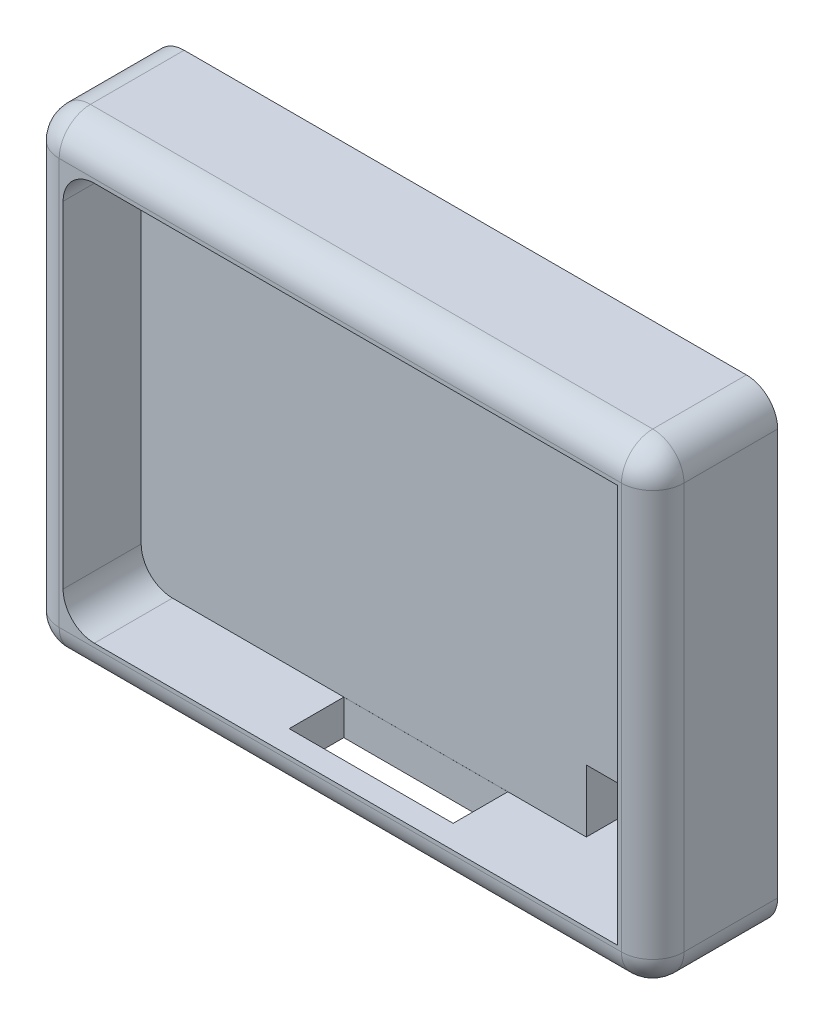
ISO-10303-21;
HEADER;
FILE_DESCRIPTION(('STEP AP214'),'2;1');
FILE_NAME('part.step','',(''),(''),'','','');
FILE_SCHEMA(('AUTOMOTIVE_DESIGN { 1 0 10303 214 1 1 1 1 }'));
ENDSEC;
DATA;
#1=APPLICATION_CONTEXT('core data for automotive mechanical design processes');
#2=APPLICATION_PROTOCOL_DEFINITION('international standard','automotive_design',2000,#1);
#3=PRODUCT_CONTEXT('',#1,'mechanical');
#4=PRODUCT('Part','Part','',(#3));
#5=PRODUCT_RELATED_PRODUCT_CATEGORY('part','',(#4));
#6=PRODUCT_DEFINITION_FORMATION('','',#4);
#7=PRODUCT_DEFINITION_CONTEXT('part definition',#1,'design');
#8=PRODUCT_DEFINITION('design','',#6,#7);
#9=PRODUCT_DEFINITION_SHAPE('','',#8);
#10=(LENGTH_UNIT() NAMED_UNIT(*) SI_UNIT(.MILLI.,.METRE.));
#11=(NAMED_UNIT(*) PLANE_ANGLE_UNIT() SI_UNIT($,.RADIAN.));
#12=(NAMED_UNIT(*) SI_UNIT($,.STERADIAN.) SOLID_ANGLE_UNIT());
#13=UNCERTAINTY_MEASURE_WITH_UNIT(LENGTH_MEASURE(1.E-05),#10,'distance_accuracy_value','');
#14=(GEOMETRIC_REPRESENTATION_CONTEXT(3) GLOBAL_UNCERTAINTY_ASSIGNED_CONTEXT((#13)) GLOBAL_UNIT_ASSIGNED_CONTEXT((#10,
#11,#12)) REPRESENTATION_CONTEXT('',''));
#15=CARTESIAN_POINT('',(0.,0.,0.));
#16=DIRECTION('',(0.,0.,1.));
#17=DIRECTION('',(1.,0.,0.));
#18=AXIS2_PLACEMENT_3D('',#15,#16,#17);
#19=CARTESIAN_POINT('',(0.,0.,8.));
#20=DIRECTION('',(1.,0.,0.));
#21=DIRECTION('',(0.,0.,-1.));
#22=AXIS2_PLACEMENT_3D('',#19,#20,#21);
#23=PLANE('',#22);
#24=DIRECTION('',(0.,-1.,0.));
#25=VECTOR('',#24,1.);
#26=CARTESIAN_POINT('',(0.,0.,0.));
#27=LINE('',#26,#25);
#28=CARTESIAN_POINT('',(0.,28.,0.));
#29=VERTEX_POINT('',#28);
#30=CARTESIAN_POINT('',(0.,2.,0.));
#31=VERTEX_POINT('',#30);
#32=EDGE_CURVE('E277',#29,#31,#27,.T.);
#33=ORIENTED_EDGE('',*,*,#32,.T.);
#34=DIRECTION('',(0.,0.,-1.));
#35=VECTOR('',#34,1.);
#36=CARTESIAN_POINT('',(0.,2.,8.));
#37=LINE('',#36,#35);
#38=CARTESIAN_POINT('',(0.,2.,6.));
#39=VERTEX_POINT('',#38);
#40=EDGE_CURVE('E342',#31,#39,#37,.F.);
#41=ORIENTED_EDGE('',*,*,#40,.T.);
#42=DIRECTION('',(0.,-1.,0.));
#43=VECTOR('',#42,1.);
#44=CARTESIAN_POINT('',(0.,0.,6.));
#45=LINE('',#44,#43);
#46=CARTESIAN_POINT('',(0.,28.,6.));
#47=VERTEX_POINT('',#46);
#48=EDGE_CURVE('E340',#39,#47,#45,.F.);
#49=ORIENTED_EDGE('',*,*,#48,.T.);
#50=DIRECTION('',(0.,0.,-1.));
#51=VECTOR('',#50,1.);
#52=CARTESIAN_POINT('',(0.,28.,8.));
#53=LINE('',#52,#51);
#54=EDGE_CURVE('E338',#47,#29,#53,.T.);
#55=ORIENTED_EDGE('',*,*,#54,.T.);
#56=EDGE_LOOP('',(#33,#41,#49,#55));
#57=FACE_BOUND('',#56,.T.);
#58=ADVANCED_FACE('F35',(#57),#23,.F.);
#59=CARTESIAN_POINT('',(0.,0.,8.));
#60=DIRECTION('',(0.,1.,0.));
#61=DIRECTION('',(0.,0.,1.));
#62=AXIS2_PLACEMENT_3D('',#59,#60,#61);
#63=PLANE('',#62);
#64=DIRECTION('',(1.,0.,0.));
#65=VECTOR('',#64,1.);
#66=CARTESIAN_POINT('',(0.,0.,6.));
#67=LINE('',#66,#65);
#68=CARTESIAN_POINT('',(38.,0.,6.));
#69=VERTEX_POINT('',#68);
#70=CARTESIAN_POINT('',(25.7257710311441,0.,6.));
#71=VERTEX_POINT('',#70);
#72=EDGE_CURVE('E321',#69,#71,#67,.F.);
#73=ORIENTED_EDGE('',*,*,#72,.T.);
#74=DIRECTION('',(0.,0.,1.));
#75=VECTOR('',#74,1.);
#76=CARTESIAN_POINT('',(25.7257710311441,0.,3.00242586469449));
#77=LINE('',#76,#75);
#78=CARTESIAN_POINT('',(25.7257710311441,0.,3.00242586469449));
#79=VERTEX_POINT('',#78);
#80=EDGE_CURVE('E226',#79,#71,#77,.T.);
#81=ORIENTED_EDGE('',*,*,#80,.F.);
#82=DIRECTION('',(1.,0.,0.));
#83=VECTOR('',#82,1.);
#84=CARTESIAN_POINT('',(15.2257710311441,0.,3.00242586469449));
#85=LINE('',#84,#83);
#86=CARTESIAN_POINT('',(15.2257710311441,0.,3.00242586469449));
#87=VERTEX_POINT('',#86);
#88=EDGE_CURVE('E223',#87,#79,#85,.T.);
#89=ORIENTED_EDGE('',*,*,#88,.F.);
#90=DIRECTION('',(0.,0.,-1.));
#91=VECTOR('',#90,1.);
#92=CARTESIAN_POINT('',(15.2257710311441,0.,3.00242586469449));
#93=LINE('',#92,#91);
#94=CARTESIAN_POINT('',(15.2257710311441,0.,6.));
#95=VERTEX_POINT('',#94);
#96=EDGE_CURVE('E201',#95,#87,#93,.T.);
#97=ORIENTED_EDGE('',*,*,#96,.F.);
#98=CARTESIAN_POINT('',(2.,0.,6.));
#99=VERTEX_POINT('',#98);
#100=EDGE_CURVE('E320',#95,#99,#67,.F.);
#101=ORIENTED_EDGE('',*,*,#100,.T.);
#102=DIRECTION('',(0.,0.,-1.));
#103=VECTOR('',#102,1.);
#104=CARTESIAN_POINT('',(2.,0.,8.));
#105=LINE('',#104,#103);
#106=CARTESIAN_POINT('',(2.,0.,0.));
#107=VERTEX_POINT('',#106);
#108=EDGE_CURVE('E324',#99,#107,#105,.T.);
#109=ORIENTED_EDGE('',*,*,#108,.T.);
#110=DIRECTION('',(1.,0.,0.));
#111=VECTOR('',#110,1.);
#112=CARTESIAN_POINT('',(0.,0.,0.));
#113=LINE('',#112,#111);
#114=CARTESIAN_POINT('',(38.,0.,0.));
#115=VERTEX_POINT('',#114);
#116=EDGE_CURVE('E282',#107,#115,#113,.T.);
#117=ORIENTED_EDGE('',*,*,#116,.T.);
#118=DIRECTION('',(0.,0.,-1.));
#119=VECTOR('',#118,1.);
#120=CARTESIAN_POINT('',(38.,0.,8.));
#121=LINE('',#120,#119);
#122=EDGE_CURVE('E318',#115,#69,#121,.F.);
#123=ORIENTED_EDGE('',*,*,#122,.T.);
#124=EDGE_LOOP('',(#73,#81,#89,#97,#101,#109,#117,#123));
#125=FACE_BOUND('',#124,.T.);
#126=ADVANCED_FACE('F396',(#125),#63,.F.);
#127=CARTESIAN_POINT('',(40.,0.,8.));
#128=DIRECTION('',(-1.,0.,0.));
#129=DIRECTION('',(0.,0.,1.));
#130=AXIS2_PLACEMENT_3D('',#127,#128,#129);
#131=PLANE('',#130);
#132=DIRECTION('',(0.,1.,0.));
#133=VECTOR('',#132,1.);
#134=CARTESIAN_POINT('',(40.,0.,6.));
#135=LINE('',#134,#133);
#136=CARTESIAN_POINT('',(40.,28.,6.));
#137=VERTEX_POINT('',#136);
#138=CARTESIAN_POINT('',(40.,2.,6.));
#139=VERTEX_POINT('',#138);
#140=EDGE_CURVE('E328',#137,#139,#135,.F.);
#141=ORIENTED_EDGE('',*,*,#140,.T.);
#142=DIRECTION('',(0.,0.,-1.));
#143=VECTOR('',#142,1.);
#144=CARTESIAN_POINT('',(40.,2.,8.));
#145=LINE('',#144,#143);
#146=CARTESIAN_POINT('',(40.,2.,0.));
#147=VERTEX_POINT('',#146);
#148=EDGE_CURVE('E330',#139,#147,#145,.T.);
#149=ORIENTED_EDGE('',*,*,#148,.T.);
#150=DIRECTION('',(0.,1.,0.));
#151=VECTOR('',#150,1.);
#152=CARTESIAN_POINT('',(40.,0.,0.));
#153=LINE('',#152,#151);
#154=CARTESIAN_POINT('',(40.,28.,0.));
#155=VERTEX_POINT('',#154);
#156=EDGE_CURVE('E285',#147,#155,#153,.T.);
#157=ORIENTED_EDGE('',*,*,#156,.T.);
#158=DIRECTION('',(0.,0.,-1.));
#159=VECTOR('',#158,1.);
#160=CARTESIAN_POINT('',(40.,28.,8.));
#161=LINE('',#160,#159);
#162=EDGE_CURVE('E326',#155,#137,#161,.F.);
#163=ORIENTED_EDGE('',*,*,#162,.T.);
#164=EDGE_LOOP('',(#141,#149,#157,#163));
#165=FACE_BOUND('',#164,.T.);
#166=ADVANCED_FACE('F442',(#165),#131,.F.);
#167=CARTESIAN_POINT('',(0.,30.,8.));
#168=DIRECTION('',(0.,-1.,0.));
#169=DIRECTION('',(0.,0.,-1.));
#170=AXIS2_PLACEMENT_3D('',#167,#168,#169);
#171=PLANE('',#170);
#172=DIRECTION('',(-1.,0.,0.));
#173=VECTOR('',#172,1.);
#174=CARTESIAN_POINT('',(0.,30.,6.));
#175=LINE('',#174,#173);
#176=CARTESIAN_POINT('',(2.,30.,6.));
#177=VERTEX_POINT('',#176);
#178=CARTESIAN_POINT('',(38.,30.,6.));
#179=VERTEX_POINT('',#178);
#180=EDGE_CURVE('E334',#177,#179,#175,.F.);
#181=ORIENTED_EDGE('',*,*,#180,.T.);
#182=DIRECTION('',(0.,0.,-1.));
#183=VECTOR('',#182,1.);
#184=CARTESIAN_POINT('',(38.,30.,8.));
#185=LINE('',#184,#183);
#186=CARTESIAN_POINT('',(38.,30.,0.));
#187=VERTEX_POINT('',#186);
#188=EDGE_CURVE('E336',#179,#187,#185,.T.);
#189=ORIENTED_EDGE('',*,*,#188,.T.);
#190=DIRECTION('',(-1.,0.,0.));
#191=VECTOR('',#190,1.);
#192=CARTESIAN_POINT('',(0.,30.,0.));
#193=LINE('',#192,#191);
#194=CARTESIAN_POINT('',(2.,30.,0.));
#195=VERTEX_POINT('',#194);
#196=EDGE_CURVE('E288',#187,#195,#193,.T.);
#197=ORIENTED_EDGE('',*,*,#196,.T.);
#198=DIRECTION('',(0.,0.,-1.));
#199=VECTOR('',#198,1.);
#200=CARTESIAN_POINT('',(2.,30.,8.));
#201=LINE('',#200,#199);
#202=EDGE_CURVE('E332',#195,#177,#201,.F.);
#203=ORIENTED_EDGE('',*,*,#202,.T.);
#204=EDGE_LOOP('',(#181,#189,#197,#203));
#205=FACE_BOUND('',#204,.T.);
#206=ADVANCED_FACE('F687',(#205),#171,.F.);
#207=CARTESIAN_POINT('',(0.,0.,8.));
#208=DIRECTION('',(0.,0.,-1.));
#209=DIRECTION('',(-1.,0.,0.));
#210=AXIS2_PLACEMENT_3D('',#207,#208,#209);
#211=PLANE('',#210);
#212=DIRECTION('',(0.,-1.,0.));
#213=VECTOR('',#212,1.);
#214=CARTESIAN_POINT('',(2.,0.,8.));
#215=LINE('',#214,#213);
#216=CARTESIAN_POINT('',(2.,28.,8.));
#217=VERTEX_POINT('',#216);
#218=CARTESIAN_POINT('',(2.,2.,8.));
#219=VERTEX_POINT('',#218);
#220=EDGE_CURVE('E309',#217,#219,#215,.T.);
#221=ORIENTED_EDGE('',*,*,#220,.T.);
#222=DIRECTION('',(1.,0.,0.));
#223=VECTOR('',#222,1.);
#224=CARTESIAN_POINT('',(0.,2.,8.));
#225=LINE('',#224,#223);
#226=CARTESIAN_POINT('',(38.,2.,8.));
#227=VERTEX_POINT('',#226);
#228=EDGE_CURVE('E315',#219,#227,#225,.T.);
#229=ORIENTED_EDGE('',*,*,#228,.T.);
#230=DIRECTION('',(0.,1.,0.));
#231=VECTOR('',#230,1.);
#232=CARTESIAN_POINT('',(38.,0.,8.));
#233=LINE('',#232,#231);
#234=CARTESIAN_POINT('',(38.,28.,8.));
#235=VERTEX_POINT('',#234);
#236=EDGE_CURVE('E313',#227,#235,#233,.T.);
#237=ORIENTED_EDGE('',*,*,#236,.T.);
#238=DIRECTION('',(-1.,0.,0.));
#239=VECTOR('',#238,1.);
#240=CARTESIAN_POINT('',(0.,28.,8.));
#241=LINE('',#240,#239);
#242=EDGE_CURVE('E311',#235,#217,#241,.T.);
#243=ORIENTED_EDGE('',*,*,#242,.T.);
#244=EDGE_LOOP('',(#221,#229,#237,#243));
#245=FACE_BOUND('',#244,.T.);
#246=DIRECTION('',(-1.,0.,0.));
#247=VECTOR('',#246,1.);
#248=CARTESIAN_POINT('',(2.25,27.75,8.));
#249=LINE('',#248,#247);
#250=CARTESIAN_POINT('',(37.75,27.75,8.));
#251=VERTEX_POINT('',#250);
#252=CARTESIAN_POINT('',(4.25,27.75,8.));
#253=VERTEX_POINT('',#252);
#254=EDGE_CURVE('E266',#251,#253,#249,.T.);
#255=ORIENTED_EDGE('',*,*,#254,.F.);
#256=DIRECTION('',(0.,1.,0.));
#257=VECTOR('',#256,1.);
#258=CARTESIAN_POINT('',(37.75,27.75,8.));
#259=LINE('',#258,#257);
#260=CARTESIAN_POINT('',(37.75,2.25,8.));
#261=VERTEX_POINT('',#260);
#262=EDGE_CURVE('E264',#261,#251,#259,.T.);
#263=ORIENTED_EDGE('',*,*,#262,.F.);
#264=DIRECTION('',(1.,0.,0.));
#265=VECTOR('',#264,1.);
#266=CARTESIAN_POINT('',(2.25000000000001,2.25,8.));
#267=LINE('',#266,#265);
#268=CARTESIAN_POINT('',(4.25,2.25,8.));
#269=VERTEX_POINT('',#268);
#270=EDGE_CURVE('E254',#269,#261,#267,.T.);
#271=ORIENTED_EDGE('',*,*,#270,.F.);
#272=CARTESIAN_POINT('',(4.25,4.25,8.));
#273=DIRECTION('',(0.,0.,-1.));
#274=DIRECTION('',(-1.,0.,0.));
#275=AXIS2_PLACEMENT_3D('',#272,#273,#274);
#276=CIRCLE('',#275,2.);
#277=CARTESIAN_POINT('',(2.25,4.25,8.));
#278=VERTEX_POINT('',#277);
#279=EDGE_CURVE('E305',#269,#278,#276,.T.);
#280=ORIENTED_EDGE('',*,*,#279,.T.);
#281=DIRECTION('',(0.,-1.,0.));
#282=VECTOR('',#281,1.);
#283=CARTESIAN_POINT('',(2.25,27.75,8.));
#284=LINE('',#283,#282);
#285=CARTESIAN_POINT('',(2.25,25.75,8.));
#286=VERTEX_POINT('',#285);
#287=EDGE_CURVE('E270',#286,#278,#284,.T.);
#288=ORIENTED_EDGE('',*,*,#287,.F.);
#289=CARTESIAN_POINT('',(4.25,25.75,8.));
#290=DIRECTION('',(0.,0.,-1.));
#291=DIRECTION('',(-1.,0.,0.));
#292=AXIS2_PLACEMENT_3D('',#289,#290,#291);
#293=CIRCLE('',#292,2.);
#294=EDGE_CURVE('E307',#286,#253,#293,.T.);
#295=ORIENTED_EDGE('',*,*,#294,.T.);
#296=EDGE_LOOP('',(#255,#263,#271,#280,#288,#295));
#297=FACE_BOUND('',#296,.T.);
#298=ADVANCED_FACE('F417',(#245,#297),#211,.F.);
#299=CARTESIAN_POINT('',(0.,0.,0.));
#300=DIRECTION('',(0.,0.,-1.));
#301=DIRECTION('',(-1.,0.,0.));
#302=AXIS2_PLACEMENT_3D('',#299,#300,#301);
#303=PLANE('',#302);
#304=DIRECTION('',(-1.,0.,0.));
#305=VECTOR('',#304,1.);
#306=CARTESIAN_POINT('',(37.75,6.25,0.));
#307=LINE('',#306,#305);
#308=CARTESIAN_POINT('',(37.75,6.25,0.));
#309=VERTEX_POINT('',#308);
#310=CARTESIAN_POINT('',(30.75,6.25,0.));
#311=VERTEX_POINT('',#310);
#312=EDGE_CURVE('E230',#309,#311,#307,.T.);
#313=ORIENTED_EDGE('',*,*,#312,.T.);
#314=DIRECTION('',(0.,-1.,0.));
#315=VECTOR('',#314,1.);
#316=CARTESIAN_POINT('',(30.75,2.25,0.));
#317=LINE('',#316,#315);
#318=CARTESIAN_POINT('',(30.75,2.25,0.));
#319=VERTEX_POINT('',#318);
#320=EDGE_CURVE('E243',#311,#319,#317,.T.);
#321=ORIENTED_EDGE('',*,*,#320,.T.);
#322=DIRECTION('',(1.,0.,0.));
#323=VECTOR('',#322,1.);
#324=CARTESIAN_POINT('',(37.75,2.25,0.));
#325=LINE('',#324,#323);
#326=CARTESIAN_POINT('',(37.75,2.25,0.));
#327=VERTEX_POINT('',#326);
#328=EDGE_CURVE('E239',#319,#327,#325,.T.);
#329=ORIENTED_EDGE('',*,*,#328,.T.);
#330=DIRECTION('',(0.,1.,0.));
#331=VECTOR('',#330,1.);
#332=CARTESIAN_POINT('',(37.75,2.25,0.));
#333=LINE('',#332,#331);
#334=EDGE_CURVE('E235',#327,#309,#333,.T.);
#335=ORIENTED_EDGE('',*,*,#334,.T.);
#336=EDGE_LOOP('',(#313,#321,#329,#335));
#337=FACE_BOUND('',#336,.T.);
#338=ORIENTED_EDGE('',*,*,#116,.F.);
#339=CARTESIAN_POINT('',(2.,2.,0.));
#340=DIRECTION('',(0.,0.,-1.));
#341=DIRECTION('',(-1.,0.,0.));
#342=AXIS2_PLACEMENT_3D('',#339,#340,#341);
#343=CIRCLE('',#342,2.);
#344=EDGE_CURVE('E350',#107,#31,#343,.T.);
#345=ORIENTED_EDGE('',*,*,#344,.T.);
#346=ORIENTED_EDGE('',*,*,#32,.F.);
#347=CARTESIAN_POINT('',(2.,28.,0.));
#348=DIRECTION('',(0.,0.,-1.));
#349=DIRECTION('',(-1.,0.,0.));
#350=AXIS2_PLACEMENT_3D('',#347,#348,#349);
#351=CIRCLE('',#350,2.);
#352=EDGE_CURVE('E344',#29,#195,#351,.T.);
#353=ORIENTED_EDGE('',*,*,#352,.T.);
#354=ORIENTED_EDGE('',*,*,#196,.F.);
#355=CARTESIAN_POINT('',(38.,28.,0.));
#356=DIRECTION('',(0.,0.,-1.));
#357=DIRECTION('',(-1.,0.,0.));
#358=AXIS2_PLACEMENT_3D('',#355,#356,#357);
#359=CIRCLE('',#358,2.);
#360=EDGE_CURVE('E346',#187,#155,#359,.T.);
#361=ORIENTED_EDGE('',*,*,#360,.T.);
#362=ORIENTED_EDGE('',*,*,#156,.F.);
#363=CARTESIAN_POINT('',(38.,2.,0.));
#364=DIRECTION('',(0.,0.,-1.));
#365=DIRECTION('',(-1.,0.,0.));
#366=AXIS2_PLACEMENT_3D('',#363,#364,#365);
#367=CIRCLE('',#366,2.);
#368=EDGE_CURVE('E348',#147,#115,#367,.T.);
#369=ORIENTED_EDGE('',*,*,#368,.T.);
#370=EDGE_LOOP('',(#338,#345,#346,#353,#354,#361,#362,#369));
#371=FACE_BOUND('',#370,.T.);
#372=ADVANCED_FACE('F435',(#337,#371),#303,.T.);
#373=CARTESIAN_POINT('',(37.75,27.75,3.));
#374=DIRECTION('',(1.,0.,0.));
#375=DIRECTION('',(0.,1.,0.));
#376=AXIS2_PLACEMENT_3D('',#373,#374,#375);
#377=PLANE('',#376);
#378=ORIENTED_EDGE('',*,*,#262,.T.);
#379=DIRECTION('',(0.,0.,1.));
#380=VECTOR('',#379,1.);
#381=CARTESIAN_POINT('',(37.75,27.75,3.));
#382=LINE('',#381,#380);
#383=CARTESIAN_POINT('',(37.75,27.75,3.));
#384=VERTEX_POINT('',#383);
#385=EDGE_CURVE('E263',#384,#251,#382,.T.);
#386=ORIENTED_EDGE('',*,*,#385,.F.);
#387=DIRECTION('',(0.,1.,0.));
#388=VECTOR('',#387,1.);
#389=CARTESIAN_POINT('',(37.75,27.75,3.));
#390=LINE('',#389,#388);
#391=CARTESIAN_POINT('',(37.75,6.25,3.));
#392=VERTEX_POINT('',#391);
#393=EDGE_CURVE('E251',#392,#384,#390,.T.);
#394=ORIENTED_EDGE('',*,*,#393,.F.);
#395=DIRECTION('',(0.,0.,1.));
#396=VECTOR('',#395,1.);
#397=CARTESIAN_POINT('',(37.75,6.25,-8.06225774829855));
#398=LINE('',#397,#396);
#399=EDGE_CURVE('E238',#309,#392,#398,.T.);
#400=ORIENTED_EDGE('',*,*,#399,.F.);
#401=ORIENTED_EDGE('',*,*,#334,.F.);
#402=DIRECTION('',(0.,0.,1.));
#403=VECTOR('',#402,1.);
#404=CARTESIAN_POINT('',(37.75,2.25,3.));
#405=LINE('',#404,#403);
#406=EDGE_CURVE('E274',#327,#261,#405,.T.);
#407=ORIENTED_EDGE('',*,*,#406,.T.);
#408=EDGE_LOOP('',(#378,#386,#394,#400,#401,#407));
#409=FACE_BOUND('',#408,.T.);
#410=ADVANCED_FACE('F564',(#409),#377,.F.);
#411=CARTESIAN_POINT('',(2.25000000000001,2.25,3.));
#412=DIRECTION('',(0.,-1.,0.));
#413=DIRECTION('',(0.,0.,-1.));
#414=AXIS2_PLACEMENT_3D('',#411,#412,#413);
#415=PLANE('',#414);
#416=DIRECTION('',(-1.,0.,0.));
#417=VECTOR('',#416,1.);
#418=CARTESIAN_POINT('',(15.2257710311441,2.25,3.00242586469449));
#419=LINE('',#418,#417);
#420=CARTESIAN_POINT('',(25.7257710311441,2.25,3.00242586469449));
#421=VERTEX_POINT('',#420);
#422=CARTESIAN_POINT('',(15.2257710311441,2.25,3.00242586469449));
#423=VERTEX_POINT('',#422);
#424=EDGE_CURVE('E207',#421,#423,#419,.T.);
#425=ORIENTED_EDGE('',*,*,#424,.F.);
#426=DIRECTION('',(0.,0.,-1.));
#427=VECTOR('',#426,1.);
#428=CARTESIAN_POINT('',(25.7257710311441,2.25,3.00242586469449));
#429=LINE('',#428,#427);
#430=CARTESIAN_POINT('',(25.7257710311441,2.25,6.50242586469449));
#431=VERTEX_POINT('',#430);
#432=EDGE_CURVE('E50',#431,#421,#429,.T.);
#433=ORIENTED_EDGE('',*,*,#432,.F.);
#434=DIRECTION('',(1.,0.,0.));
#435=VECTOR('',#434,1.);
#436=CARTESIAN_POINT('',(15.2257710311441,2.25,6.50242586469449));
#437=LINE('',#436,#435);
#438=CARTESIAN_POINT('',(15.2257710311441,2.25,6.50242586469449));
#439=VERTEX_POINT('',#438);
#440=EDGE_CURVE('E214',#439,#431,#437,.T.);
#441=ORIENTED_EDGE('',*,*,#440,.F.);
#442=DIRECTION('',(0.,0.,1.));
#443=VECTOR('',#442,1.);
#444=CARTESIAN_POINT('',(15.2257710311441,2.25,3.00242586469449));
#445=LINE('',#444,#443);
#446=EDGE_CURVE('E198',#423,#439,#445,.T.);
#447=ORIENTED_EDGE('',*,*,#446,.F.);
#448=EDGE_LOOP('',(#425,#433,#441,#447));
#449=FACE_BOUND('',#448,.T.);
#450=DIRECTION('',(1.,0.,0.));
#451=VECTOR('',#450,1.);
#452=CARTESIAN_POINT('',(2.25000000000001,2.25,3.));
#453=LINE('',#452,#451);
#454=CARTESIAN_POINT('',(4.25,2.25,3.));
#455=VERTEX_POINT('',#454);
#456=CARTESIAN_POINT('',(30.75,2.25,3.));
#457=VERTEX_POINT('',#456);
#458=EDGE_CURVE('E260',#455,#457,#453,.T.);
#459=ORIENTED_EDGE('',*,*,#458,.F.);
#460=DIRECTION('',(0.,0.,1.));
#461=VECTOR('',#460,1.);
#462=CARTESIAN_POINT('',(4.25,2.25,8.));
#463=LINE('',#462,#461);
#464=EDGE_CURVE('E291',#455,#269,#463,.T.);
#465=ORIENTED_EDGE('',*,*,#464,.T.);
#466=ORIENTED_EDGE('',*,*,#270,.T.);
#467=ORIENTED_EDGE('',*,*,#406,.F.);
#468=ORIENTED_EDGE('',*,*,#328,.F.);
#469=DIRECTION('',(0.,0.,1.));
#470=VECTOR('',#469,1.);
#471=CARTESIAN_POINT('',(30.75,2.25,-8.06225774829855));
#472=LINE('',#471,#470);
#473=EDGE_CURVE('E242',#319,#457,#472,.T.);
#474=ORIENTED_EDGE('',*,*,#473,.T.);
#475=EDGE_LOOP('',(#459,#465,#466,#467,#468,#474));
#476=FACE_BOUND('',#475,.T.);
#477=ADVANCED_FACE('F211',(#449,#476),#415,.F.);
#478=CARTESIAN_POINT('',(2.25,27.75,3.));
#479=DIRECTION('',(-1.,0.,0.));
#480=DIRECTION('',(0.,-1.,0.));
#481=AXIS2_PLACEMENT_3D('',#478,#479,#480);
#482=PLANE('',#481);
#483=ORIENTED_EDGE('',*,*,#287,.T.);
#484=DIRECTION('',(0.,0.,1.));
#485=VECTOR('',#484,1.);
#486=CARTESIAN_POINT('',(2.25,4.25,3.));
#487=LINE('',#486,#485);
#488=CARTESIAN_POINT('',(2.25,4.25,3.));
#489=VERTEX_POINT('',#488);
#490=EDGE_CURVE('E297',#278,#489,#487,.F.);
#491=ORIENTED_EDGE('',*,*,#490,.T.);
#492=DIRECTION('',(0.,-1.,0.));
#493=VECTOR('',#492,1.);
#494=CARTESIAN_POINT('',(2.25,27.75,3.));
#495=LINE('',#494,#493);
#496=CARTESIAN_POINT('',(2.25,25.75,3.));
#497=VERTEX_POINT('',#496);
#498=EDGE_CURVE('E257',#497,#489,#495,.T.);
#499=ORIENTED_EDGE('',*,*,#498,.F.);
#500=DIRECTION('',(0.,0.,1.));
#501=VECTOR('',#500,1.);
#502=CARTESIAN_POINT('',(2.25,25.75,8.));
#503=LINE('',#502,#501);
#504=EDGE_CURVE('E294',#497,#286,#503,.T.);
#505=ORIENTED_EDGE('',*,*,#504,.T.);
#506=EDGE_LOOP('',(#483,#491,#499,#505));
#507=FACE_BOUND('',#506,.T.);
#508=ADVANCED_FACE('F563',(#507),#482,.F.);
#509=CARTESIAN_POINT('',(2.25,27.75,3.));
#510=DIRECTION('',(0.,1.,0.));
#511=DIRECTION('',(0.,0.,1.));
#512=AXIS2_PLACEMENT_3D('',#509,#510,#511);
#513=PLANE('',#512);
#514=ORIENTED_EDGE('',*,*,#254,.T.);
#515=DIRECTION('',(0.,0.,1.));
#516=VECTOR('',#515,1.);
#517=CARTESIAN_POINT('',(4.25,27.75,3.));
#518=LINE('',#517,#516);
#519=CARTESIAN_POINT('',(4.25,27.75,3.));
#520=VERTEX_POINT('',#519);
#521=EDGE_CURVE('E303',#253,#520,#518,.F.);
#522=ORIENTED_EDGE('',*,*,#521,.T.);
#523=DIRECTION('',(-1.,0.,0.));
#524=VECTOR('',#523,1.);
#525=CARTESIAN_POINT('',(2.25,27.75,3.));
#526=LINE('',#525,#524);
#527=EDGE_CURVE('E253',#384,#520,#526,.T.);
#528=ORIENTED_EDGE('',*,*,#527,.F.);
#529=ORIENTED_EDGE('',*,*,#385,.T.);
#530=EDGE_LOOP('',(#514,#522,#528,#529));
#531=FACE_BOUND('',#530,.T.);
#532=ADVANCED_FACE('F588',(#531),#513,.F.);
#533=CARTESIAN_POINT('',(0.,0.,3.));
#534=DIRECTION('',(0.,0.,1.));
#535=DIRECTION('',(1.,0.,0.));
#536=AXIS2_PLACEMENT_3D('',#533,#534,#535);
#537=PLANE('',#536);
#538=DIRECTION('',(-1.,0.,0.));
#539=VECTOR('',#538,1.);
#540=CARTESIAN_POINT('',(37.75,6.25,3.));
#541=LINE('',#540,#539);
#542=CARTESIAN_POINT('',(30.75,6.25,3.));
#543=VERTEX_POINT('',#542);
#544=EDGE_CURVE('E225',#392,#543,#541,.T.);
#545=ORIENTED_EDGE('',*,*,#544,.F.);
#546=ORIENTED_EDGE('',*,*,#393,.T.);
#547=ORIENTED_EDGE('',*,*,#527,.T.);
#548=CARTESIAN_POINT('',(4.25,25.75,3.));
#549=DIRECTION('',(0.,0.,1.));
#550=DIRECTION('',(1.,0.,0.));
#551=AXIS2_PLACEMENT_3D('',#548,#549,#550);
#552=CIRCLE('',#551,2.);
#553=EDGE_CURVE('E299',#520,#497,#552,.T.);
#554=ORIENTED_EDGE('',*,*,#553,.T.);
#555=ORIENTED_EDGE('',*,*,#498,.T.);
#556=CARTESIAN_POINT('',(4.25,4.25,3.));
#557=DIRECTION('',(0.,0.,1.));
#558=DIRECTION('',(1.,0.,0.));
#559=AXIS2_PLACEMENT_3D('',#556,#557,#558);
#560=CIRCLE('',#559,2.);
#561=EDGE_CURVE('E301',#489,#455,#560,.T.);
#562=ORIENTED_EDGE('',*,*,#561,.T.);
#563=ORIENTED_EDGE('',*,*,#458,.T.);
#564=DIRECTION('',(0.,-1.,0.));
#565=VECTOR('',#564,1.);
#566=CARTESIAN_POINT('',(30.75,2.25,3.));
#567=LINE('',#566,#565);
#568=EDGE_CURVE('E227',#543,#457,#567,.T.);
#569=ORIENTED_EDGE('',*,*,#568,.F.);
#570=EDGE_LOOP('',(#545,#546,#547,#554,#555,#562,#563,#569));
#571=FACE_BOUND('',#570,.T.);
#572=ADVANCED_FACE('F476',(#571),#537,.T.);
#573=CARTESIAN_POINT('',(4.25,4.25,3.));
#574=DIRECTION('',(0.,0.,-1.));
#575=DIRECTION('',(-1.,0.,0.));
#576=AXIS2_PLACEMENT_3D('',#573,#574,#575);
#577=CYLINDRICAL_SURFACE('',#576,2.);
#578=ORIENTED_EDGE('',*,*,#561,.F.);
#579=ORIENTED_EDGE('',*,*,#490,.F.);
#580=ORIENTED_EDGE('',*,*,#279,.F.);
#581=ORIENTED_EDGE('',*,*,#464,.F.);
#582=EDGE_LOOP('',(#578,#579,#580,#581));
#583=FACE_BOUND('',#582,.T.);
#584=ADVANCED_FACE('F472',(#583),#577,.F.);
#585=CARTESIAN_POINT('',(4.25,25.75,3.));
#586=DIRECTION('',(0.,0.,-1.));
#587=DIRECTION('',(-1.,0.,0.));
#588=AXIS2_PLACEMENT_3D('',#585,#586,#587);
#589=CYLINDRICAL_SURFACE('',#588,2.);
#590=ORIENTED_EDGE('',*,*,#553,.F.);
#591=ORIENTED_EDGE('',*,*,#521,.F.);
#592=ORIENTED_EDGE('',*,*,#294,.F.);
#593=ORIENTED_EDGE('',*,*,#504,.F.);
#594=EDGE_LOOP('',(#590,#591,#592,#593));
#595=FACE_BOUND('',#594,.T.);
#596=ADVANCED_FACE('F475',(#595),#589,.F.);
#597=CARTESIAN_POINT('',(2.,28.,8.));
#598=DIRECTION('',(0.,0.,-1.));
#599=DIRECTION('',(-1.,0.,0.));
#600=AXIS2_PLACEMENT_3D('',#597,#598,#599);
#601=CYLINDRICAL_SURFACE('',#600,2.);
#602=ORIENTED_EDGE('',*,*,#352,.F.);
#603=ORIENTED_EDGE('',*,*,#54,.F.);
#604=CARTESIAN_POINT('',(2.,28.,6.));
#605=DIRECTION('',(0.,0.,1.));
#606=DIRECTION('',(1.,0.,0.));
#607=AXIS2_PLACEMENT_3D('',#604,#605,#606);
#608=CIRCLE('',#607,2.);
#609=EDGE_CURVE('E267',#177,#47,#608,.T.);
#610=ORIENTED_EDGE('',*,*,#609,.F.);
#611=ORIENTED_EDGE('',*,*,#202,.F.);
#612=EDGE_LOOP('',(#602,#603,#610,#611));
#613=FACE_BOUND('',#612,.T.);
#614=ADVANCED_FACE('F37',(#613),#601,.T.);
#615=CARTESIAN_POINT('',(0.,28.,6.));
#616=DIRECTION('',(-1.,0.,0.));
#617=DIRECTION('',(0.,0.,1.));
#618=AXIS2_PLACEMENT_3D('',#615,#616,#617);
#619=CYLINDRICAL_SURFACE('',#618,2.);
#620=CARTESIAN_POINT('',(38.,28.,6.));
#621=DIRECTION('',(1.,0.,0.));
#622=DIRECTION('',(0.,0.,-1.));
#623=AXIS2_PLACEMENT_3D('',#620,#621,#622);
#624=CIRCLE('',#623,2.);
#625=EDGE_CURVE('E378',#179,#235,#624,.T.);
#626=ORIENTED_EDGE('',*,*,#625,.F.);
#627=ORIENTED_EDGE('',*,*,#180,.F.);
#628=CARTESIAN_POINT('',(2.,28.,6.));
#629=DIRECTION('',(-1.,0.,0.));
#630=DIRECTION('',(0.,0.,1.));
#631=AXIS2_PLACEMENT_3D('',#628,#629,#630);
#632=CIRCLE('',#631,2.);
#633=EDGE_CURVE('E381',#217,#177,#632,.T.);
#634=ORIENTED_EDGE('',*,*,#633,.F.);
#635=ORIENTED_EDGE('',*,*,#242,.F.);
#636=EDGE_LOOP('',(#626,#627,#634,#635));
#637=FACE_BOUND('',#636,.T.);
#638=ADVANCED_FACE('F610',(#637),#619,.T.);
#639=CARTESIAN_POINT('',(38.,28.,8.));
#640=DIRECTION('',(0.,0.,-1.));
#641=DIRECTION('',(-1.,0.,0.));
#642=AXIS2_PLACEMENT_3D('',#639,#640,#641);
#643=CYLINDRICAL_SURFACE('',#642,2.);
#644=ORIENTED_EDGE('',*,*,#360,.F.);
#645=ORIENTED_EDGE('',*,*,#188,.F.);
#646=CARTESIAN_POINT('',(38.,28.,6.));
#647=DIRECTION('',(0.,0.,1.));
#648=DIRECTION('',(1.,0.,0.));
#649=AXIS2_PLACEMENT_3D('',#646,#647,#648);
#650=CIRCLE('',#649,2.);
#651=EDGE_CURVE('E375',#137,#179,#650,.T.);
#652=ORIENTED_EDGE('',*,*,#651,.F.);
#653=ORIENTED_EDGE('',*,*,#162,.F.);
#654=EDGE_LOOP('',(#644,#645,#652,#653));
#655=FACE_BOUND('',#654,.T.);
#656=ADVANCED_FACE('F445',(#655),#643,.T.);
#657=CARTESIAN_POINT('',(2.,28.,6.));
#658=DIRECTION('',(0.,0.,1.));
#659=DIRECTION('',(1.,0.,0.));
#660=AXIS2_PLACEMENT_3D('',#657,#658,#659);
#661=SPHERICAL_SURFACE('',#660,2.);
#662=ORIENTED_EDGE('',*,*,#633,.T.);
#663=ORIENTED_EDGE('',*,*,#609,.T.);
#664=CARTESIAN_POINT('',(2.,28.,6.));
#665=DIRECTION('',(0.,1.,0.));
#666=DIRECTION('',(0.,0.,1.));
#667=AXIS2_PLACEMENT_3D('',#664,#665,#666);
#668=CIRCLE('',#667,2.);
#669=EDGE_CURVE('E372',#217,#47,#668,.F.);
#670=ORIENTED_EDGE('',*,*,#669,.F.);
#671=EDGE_LOOP('',(#662,#663,#670));
#672=FACE_BOUND('',#671,.T.);
#673=ADVANCED_FACE('F624',(#672),#661,.T.);
#674=CARTESIAN_POINT('',(38.,28.,6.));
#675=DIRECTION('',(0.,0.,1.));
#676=DIRECTION('',(1.,0.,0.));
#677=AXIS2_PLACEMENT_3D('',#674,#675,#676);
#678=SPHERICAL_SURFACE('',#677,2.);
#679=ORIENTED_EDGE('',*,*,#651,.T.);
#680=ORIENTED_EDGE('',*,*,#625,.T.);
#681=CARTESIAN_POINT('',(38.,28.,6.));
#682=DIRECTION('',(0.,1.,0.));
#683=DIRECTION('',(0.,0.,1.));
#684=AXIS2_PLACEMENT_3D('',#681,#682,#683);
#685=CIRCLE('',#684,2.);
#686=EDGE_CURVE('E369',#137,#235,#685,.F.);
#687=ORIENTED_EDGE('',*,*,#686,.F.);
#688=EDGE_LOOP('',(#679,#680,#687));
#689=FACE_BOUND('',#688,.T.);
#690=ADVANCED_FACE('F451',(#689),#678,.T.);
#691=CARTESIAN_POINT('',(2.,2.,8.));
#692=DIRECTION('',(0.,0.,-1.));
#693=DIRECTION('',(-1.,0.,0.));
#694=AXIS2_PLACEMENT_3D('',#691,#692,#693);
#695=CYLINDRICAL_SURFACE('',#694,2.);
#696=ORIENTED_EDGE('',*,*,#344,.F.);
#697=ORIENTED_EDGE('',*,*,#108,.F.);
#698=CARTESIAN_POINT('',(2.,2.,6.));
#699=DIRECTION('',(0.,0.,1.));
#700=DIRECTION('',(1.,0.,0.));
#701=AXIS2_PLACEMENT_3D('',#698,#699,#700);
#702=CIRCLE('',#701,2.);
#703=EDGE_CURVE('E366',#39,#99,#702,.T.);
#704=ORIENTED_EDGE('',*,*,#703,.F.);
#705=ORIENTED_EDGE('',*,*,#40,.F.);
#706=EDGE_LOOP('',(#696,#697,#704,#705));
#707=FACE_BOUND('',#706,.T.);
#708=ADVANCED_FACE('F433',(#707),#695,.T.);
#709=CARTESIAN_POINT('',(2.,0.,6.));
#710=DIRECTION('',(0.,-1.,0.));
#711=DIRECTION('',(0.,0.,-1.));
#712=AXIS2_PLACEMENT_3D('',#709,#710,#711);
#713=CYLINDRICAL_SURFACE('',#712,2.);
#714=ORIENTED_EDGE('',*,*,#669,.T.);
#715=ORIENTED_EDGE('',*,*,#48,.F.);
#716=CARTESIAN_POINT('',(2.,2.,6.));
#717=DIRECTION('',(0.,-1.,0.));
#718=DIRECTION('',(0.,0.,-1.));
#719=AXIS2_PLACEMENT_3D('',#716,#717,#718);
#720=CIRCLE('',#719,2.);
#721=EDGE_CURVE('E363',#219,#39,#720,.T.);
#722=ORIENTED_EDGE('',*,*,#721,.F.);
#723=ORIENTED_EDGE('',*,*,#220,.F.);
#724=EDGE_LOOP('',(#714,#715,#722,#723));
#725=FACE_BOUND('',#724,.T.);
#726=ADVANCED_FACE('F425',(#725),#713,.T.);
#727=CARTESIAN_POINT('',(38.,0.,6.));
#728=DIRECTION('',(0.,1.,0.));
#729=DIRECTION('',(0.,0.,1.));
#730=AXIS2_PLACEMENT_3D('',#727,#728,#729);
#731=CYLINDRICAL_SURFACE('',#730,2.);
#732=ORIENTED_EDGE('',*,*,#686,.T.);
#733=ORIENTED_EDGE('',*,*,#236,.F.);
#734=CARTESIAN_POINT('',(38.,2.,6.));
#735=DIRECTION('',(0.,-1.,0.));
#736=DIRECTION('',(0.,0.,-1.));
#737=AXIS2_PLACEMENT_3D('',#734,#735,#736);
#738=CIRCLE('',#737,2.);
#739=EDGE_CURVE('E360',#139,#227,#738,.T.);
#740=ORIENTED_EDGE('',*,*,#739,.F.);
#741=ORIENTED_EDGE('',*,*,#140,.F.);
#742=EDGE_LOOP('',(#732,#733,#740,#741));
#743=FACE_BOUND('',#742,.T.);
#744=ADVANCED_FACE('F453',(#743),#731,.T.);
#745=CARTESIAN_POINT('',(38.,2.,8.));
#746=DIRECTION('',(0.,0.,-1.));
#747=DIRECTION('',(-1.,0.,0.));
#748=AXIS2_PLACEMENT_3D('',#745,#746,#747);
#749=CYLINDRICAL_SURFACE('',#748,2.);
#750=ORIENTED_EDGE('',*,*,#368,.F.);
#751=ORIENTED_EDGE('',*,*,#148,.F.);
#752=CARTESIAN_POINT('',(38.,2.,6.));
#753=DIRECTION('',(0.,0.,1.));
#754=DIRECTION('',(1.,0.,0.));
#755=AXIS2_PLACEMENT_3D('',#752,#753,#754);
#756=CIRCLE('',#755,2.);
#757=EDGE_CURVE('E357',#69,#139,#756,.T.);
#758=ORIENTED_EDGE('',*,*,#757,.F.);
#759=ORIENTED_EDGE('',*,*,#122,.F.);
#760=EDGE_LOOP('',(#750,#751,#758,#759));
#761=FACE_BOUND('',#760,.T.);
#762=ADVANCED_FACE('F409',(#761),#749,.T.);
#763=CARTESIAN_POINT('',(2.,2.,6.));
#764=DIRECTION('',(0.,0.,1.));
#765=DIRECTION('',(1.,0.,0.));
#766=AXIS2_PLACEMENT_3D('',#763,#764,#765);
#767=SPHERICAL_SURFACE('',#766,2.);
#768=ORIENTED_EDGE('',*,*,#721,.T.);
#769=ORIENTED_EDGE('',*,*,#703,.T.);
#770=CARTESIAN_POINT('',(2.,2.,6.));
#771=DIRECTION('',(-1.,0.,0.));
#772=DIRECTION('',(0.,0.,1.));
#773=AXIS2_PLACEMENT_3D('',#770,#771,#772);
#774=CIRCLE('',#773,2.);
#775=EDGE_CURVE('E354',#219,#99,#774,.F.);
#776=ORIENTED_EDGE('',*,*,#775,.F.);
#777=EDGE_LOOP('',(#768,#769,#776));
#778=FACE_BOUND('',#777,.T.);
#779=ADVANCED_FACE('F428',(#778),#767,.T.);
#780=CARTESIAN_POINT('',(38.,2.,6.));
#781=DIRECTION('',(0.,0.,1.));
#782=DIRECTION('',(1.,0.,0.));
#783=AXIS2_PLACEMENT_3D('',#780,#781,#782);
#784=SPHERICAL_SURFACE('',#783,2.);
#785=ORIENTED_EDGE('',*,*,#757,.T.);
#786=ORIENTED_EDGE('',*,*,#739,.T.);
#787=CARTESIAN_POINT('',(38.,2.,6.));
#788=DIRECTION('',(1.,0.,0.));
#789=DIRECTION('',(0.,0.,-1.));
#790=AXIS2_PLACEMENT_3D('',#787,#788,#789);
#791=CIRCLE('',#790,2.);
#792=EDGE_CURVE('E250',#69,#227,#791,.F.);
#793=ORIENTED_EDGE('',*,*,#792,.F.);
#794=EDGE_LOOP('',(#785,#786,#793));
#795=FACE_BOUND('',#794,.T.);
#796=ADVANCED_FACE('F412',(#795),#784,.T.);
#797=CARTESIAN_POINT('',(0.,2.,6.));
#798=DIRECTION('',(1.,0.,0.));
#799=DIRECTION('',(0.,0.,-1.));
#800=AXIS2_PLACEMENT_3D('',#797,#798,#799);
#801=CYLINDRICAL_SURFACE('',#800,2.);
#802=CARTESIAN_POINT('',(25.7257710311441,2.,6.));
#803=DIRECTION('',(1.,0.,0.));
#804=DIRECTION('',(0.,0.,-1.));
#805=AXIS2_PLACEMENT_3D('',#802,#803,#804);
#806=CIRCLE('',#805,2.);
#807=CARTESIAN_POINT('',(25.7257710311441,0.064136303742952,6.50242586469449));
#808=VERTEX_POINT('',#807);
#809=EDGE_CURVE('E11',#71,#808,#806,.F.);
#810=ORIENTED_EDGE('',*,*,#809,.F.);
#811=ORIENTED_EDGE('',*,*,#72,.F.);
#812=ORIENTED_EDGE('',*,*,#792,.T.);
#813=ORIENTED_EDGE('',*,*,#228,.F.);
#814=ORIENTED_EDGE('',*,*,#775,.T.);
#815=ORIENTED_EDGE('',*,*,#100,.F.);
#816=CARTESIAN_POINT('',(15.2257710311441,2.,6.));
#817=DIRECTION('',(-1.,0.,0.));
#818=DIRECTION('',(0.,0.,1.));
#819=AXIS2_PLACEMENT_3D('',#816,#817,#818);
#820=CIRCLE('',#819,2.);
#821=CARTESIAN_POINT('',(15.2257710311441,0.0641363037429529,6.50242586469449));
#822=VERTEX_POINT('',#821);
#823=EDGE_CURVE('E352',#822,#95,#820,.F.);
#824=ORIENTED_EDGE('',*,*,#823,.F.);
#825=DIRECTION('',(1.,0.,0.));
#826=VECTOR('',#825,1.);
#827=CARTESIAN_POINT('',(0.,0.0641363037429529,6.50242586469449));
#828=LINE('',#827,#826);
#829=EDGE_CURVE('E43',#808,#822,#828,.F.);
#830=ORIENTED_EDGE('',*,*,#829,.F.);
#831=EDGE_LOOP('',(#810,#811,#812,#813,#814,#815,#824,#830));
#832=FACE_BOUND('',#831,.T.);
#833=ADVANCED_FACE('F394',(#832),#801,.T.);
#834=CARTESIAN_POINT('',(37.75,6.25,-8.06225774829855));
#835=DIRECTION('',(0.,1.,0.));
#836=DIRECTION('',(-1.,0.,0.));
#837=AXIS2_PLACEMENT_3D('',#834,#835,#836);
#838=PLANE('',#837);
#839=ORIENTED_EDGE('',*,*,#399,.T.);
#840=ORIENTED_EDGE('',*,*,#544,.T.);
#841=DIRECTION('',(0.,0.,1.));
#842=VECTOR('',#841,1.);
#843=CARTESIAN_POINT('',(30.75,6.25,-8.06225774829855));
#844=LINE('',#843,#842);
#845=EDGE_CURVE('E234',#311,#543,#844,.T.);
#846=ORIENTED_EDGE('',*,*,#845,.F.);
#847=ORIENTED_EDGE('',*,*,#312,.F.);
#848=EDGE_LOOP('',(#839,#840,#846,#847));
#849=FACE_BOUND('',#848,.T.);
#850=ADVANCED_FACE('F483',(#849),#838,.F.);
#851=CARTESIAN_POINT('',(30.75,2.25,-8.06225774829855));
#852=DIRECTION('',(-1.,0.,0.));
#853=DIRECTION('',(0.,0.,1.));
#854=AXIS2_PLACEMENT_3D('',#851,#852,#853);
#855=PLANE('',#854);
#856=ORIENTED_EDGE('',*,*,#845,.T.);
#857=ORIENTED_EDGE('',*,*,#568,.T.);
#858=ORIENTED_EDGE('',*,*,#473,.F.);
#859=ORIENTED_EDGE('',*,*,#320,.F.);
#860=EDGE_LOOP('',(#856,#857,#858,#859));
#861=FACE_BOUND('',#860,.T.);
#862=ADVANCED_FACE('F511',(#861),#855,.F.);
#863=CARTESIAN_POINT('',(25.7257710311441,-11.0679718105893,3.00242586469449));
#864=DIRECTION('',(1.,0.,0.));
#865=DIRECTION('',(0.,0.,-1.));
#866=AXIS2_PLACEMENT_3D('',#863,#864,#865);
#867=PLANE('',#866);
#868=ORIENTED_EDGE('',*,*,#809,.T.);
#869=DIRECTION('',(0.,1.,0.));
#870=VECTOR('',#869,1.);
#871=CARTESIAN_POINT('',(25.7257710311441,-11.0679718105893,6.50242586469449));
#872=LINE('',#871,#870);
#873=EDGE_CURVE('E219',#808,#431,#872,.T.);
#874=ORIENTED_EDGE('',*,*,#873,.T.);
#875=ORIENTED_EDGE('',*,*,#432,.T.);
#876=DIRECTION('',(0.,1.,0.));
#877=VECTOR('',#876,1.);
#878=CARTESIAN_POINT('',(25.7257710311441,-11.0679718105893,3.00242586469449));
#879=LINE('',#878,#877);
#880=EDGE_CURVE('E204',#79,#421,#879,.T.);
#881=ORIENTED_EDGE('',*,*,#880,.F.);
#882=ORIENTED_EDGE('',*,*,#80,.T.);
#883=EDGE_LOOP('',(#868,#874,#875,#881,#882));
#884=FACE_BOUND('',#883,.T.);
#885=ADVANCED_FACE('F400',(#884),#867,.F.);
#886=CARTESIAN_POINT('',(15.2257710311441,-11.0679718105893,6.50242586469449));
#887=DIRECTION('',(0.,0.,1.));
#888=DIRECTION('',(1.,0.,0.));
#889=AXIS2_PLACEMENT_3D('',#886,#887,#888);
#890=PLANE('',#889);
#891=ORIENTED_EDGE('',*,*,#829,.T.);
#892=DIRECTION('',(0.,1.,0.));
#893=VECTOR('',#892,1.);
#894=CARTESIAN_POINT('',(15.2257710311441,-11.0679718105893,6.50242586469449));
#895=LINE('',#894,#893);
#896=EDGE_CURVE('E58',#822,#439,#895,.T.);
#897=ORIENTED_EDGE('',*,*,#896,.T.);
#898=ORIENTED_EDGE('',*,*,#440,.T.);
#899=ORIENTED_EDGE('',*,*,#873,.F.);
#900=EDGE_LOOP('',(#891,#897,#898,#899));
#901=FACE_BOUND('',#900,.T.);
#902=ADVANCED_FACE('F390',(#901),#890,.F.);
#903=CARTESIAN_POINT('',(15.2257710311441,-11.0679718105893,3.00242586469449));
#904=DIRECTION('',(-1.,0.,0.));
#905=DIRECTION('',(0.,0.,1.));
#906=AXIS2_PLACEMENT_3D('',#903,#904,#905);
#907=PLANE('',#906);
#908=ORIENTED_EDGE('',*,*,#823,.T.);
#909=ORIENTED_EDGE('',*,*,#96,.T.);
#910=DIRECTION('',(0.,1.,0.));
#911=VECTOR('',#910,1.);
#912=CARTESIAN_POINT('',(15.2257710311441,-11.0679718105893,3.00242586469449));
#913=LINE('',#912,#911);
#914=EDGE_CURVE('E194',#87,#423,#913,.T.);
#915=ORIENTED_EDGE('',*,*,#914,.T.);
#916=ORIENTED_EDGE('',*,*,#446,.T.);
#917=ORIENTED_EDGE('',*,*,#896,.F.);
#918=EDGE_LOOP('',(#908,#909,#915,#916,#917));
#919=FACE_BOUND('',#918,.T.);
#920=ADVANCED_FACE('F196',(#919),#907,.F.);
#921=CARTESIAN_POINT('',(15.2257710311441,-11.0679718105893,3.00242586469449));
#922=DIRECTION('',(0.,0.,-1.));
#923=DIRECTION('',(-1.,0.,0.));
#924=AXIS2_PLACEMENT_3D('',#921,#922,#923);
#925=PLANE('',#924);
#926=ORIENTED_EDGE('',*,*,#88,.T.);
#927=ORIENTED_EDGE('',*,*,#880,.T.);
#928=ORIENTED_EDGE('',*,*,#424,.T.);
#929=ORIENTED_EDGE('',*,*,#914,.F.);
#930=EDGE_LOOP('',(#926,#927,#928,#929));
#931=FACE_BOUND('',#930,.T.);
#932=ADVANCED_FACE('F208',(#931),#925,.F.);
#933=CLOSED_SHELL('',(#58,#126,#166,#206,#298,#372,#410,#477,#508,#532,#572,#584,#596,#614,#638,
#656,#673,#690,#708,#726,#744,#762,#779,#796,#833,#850,#862,#885,#902,#920,#932));
#934=MANIFOLD_SOLID_BREP('B2',#933);
#935=ADVANCED_BREP_SHAPE_REPRESENTATION('',(#18,#934),#14);
#936=SHAPE_DEFINITION_REPRESENTATION(#9,#935);
ENDSEC;
END-ISO-10303-21;
